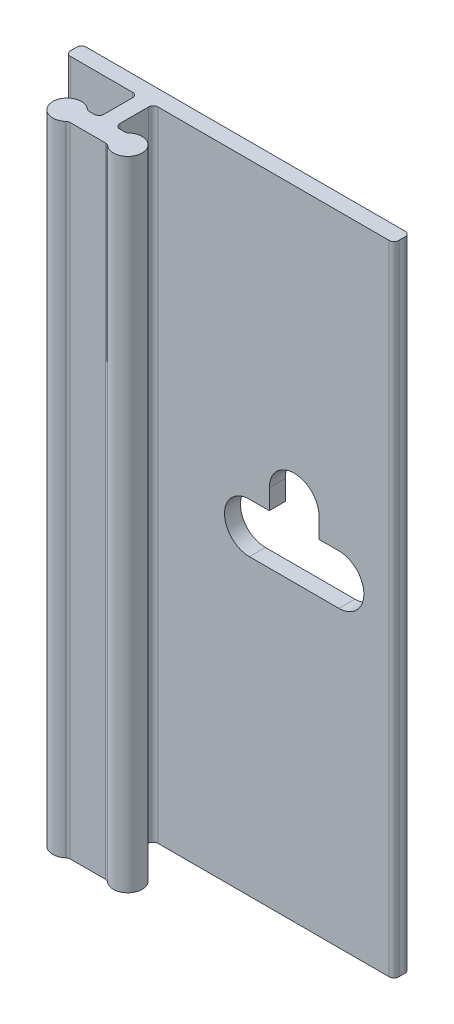
ISO-10303-21;
HEADER;
FILE_DESCRIPTION(('STEP AP214'),'2;1');
FILE_NAME('part.step','',(''),(''),'','','');
FILE_SCHEMA(('AUTOMOTIVE_DESIGN { 1 0 10303 214 1 1 1 1 }'));
ENDSEC;
DATA;
#1=APPLICATION_CONTEXT('core data for automotive mechanical design processes');
#2=APPLICATION_PROTOCOL_DEFINITION('international standard','automotive_design',2000,#1);
#3=PRODUCT_CONTEXT('',#1,'mechanical');
#4=PRODUCT('Part','Part','',(#3));
#5=PRODUCT_RELATED_PRODUCT_CATEGORY('part','',(#4));
#6=PRODUCT_DEFINITION_FORMATION('','',#4);
#7=PRODUCT_DEFINITION_CONTEXT('part definition',#1,'design');
#8=PRODUCT_DEFINITION('design','',#6,#7);
#9=PRODUCT_DEFINITION_SHAPE('','',#8);
#10=(LENGTH_UNIT() NAMED_UNIT(*) SI_UNIT(.MILLI.,.METRE.));
#11=(NAMED_UNIT(*) PLANE_ANGLE_UNIT() SI_UNIT($,.RADIAN.));
#12=(NAMED_UNIT(*) SI_UNIT($,.STERADIAN.) SOLID_ANGLE_UNIT());
#13=UNCERTAINTY_MEASURE_WITH_UNIT(LENGTH_MEASURE(1.E-05),#10,'distance_accuracy_value','');
#14=(GEOMETRIC_REPRESENTATION_CONTEXT(3) GLOBAL_UNCERTAINTY_ASSIGNED_CONTEXT((#13)) GLOBAL_UNIT_ASSIGNED_CONTEXT((#10,
#11,#12)) REPRESENTATION_CONTEXT('',''));
#15=CARTESIAN_POINT('',(0.,0.,0.));
#16=DIRECTION('',(0.,0.,1.));
#17=DIRECTION('',(1.,0.,0.));
#18=AXIS2_PLACEMENT_3D('',#15,#16,#17);
#19=CARTESIAN_POINT('',(-5.96900000000001,50.8,0.381));
#20=DIRECTION('',(0.,-1.,0.));
#21=DIRECTION('',(0.,0.,-1.));
#22=AXIS2_PLACEMENT_3D('',#19,#20,#21);
#23=CYLINDRICAL_SURFACE('',#22,0.381);
#24=CARTESIAN_POINT('',(-5.96900000000001,0.,0.381));
#25=DIRECTION('',(0.,1.,0.));
#26=DIRECTION('',(0.,0.,-1.));
#27=AXIS2_PLACEMENT_3D('',#24,#25,#26);
#28=CIRCLE('',#27,0.381);
#29=CARTESIAN_POINT('',(-5.96900000000001,0.,0.));
#30=VERTEX_POINT('',#29);
#31=CARTESIAN_POINT('',(-6.35000000000001,0.,0.381000000000002));
#32=VERTEX_POINT('',#31);
#33=EDGE_CURVE('E297',#30,#32,#28,.T.);
#34=ORIENTED_EDGE('',*,*,#33,.T.);
#35=DIRECTION('',(0.,-1.,0.));
#36=VECTOR('',#35,1.);
#37=CARTESIAN_POINT('',(-6.35000000000001,50.8,0.381000000000002));
#38=LINE('',#37,#36);
#39=CARTESIAN_POINT('',(-6.35000000000001,50.8,0.381000000000002));
#40=VERTEX_POINT('',#39);
#41=EDGE_CURVE('E11',#40,#32,#38,.T.);
#42=ORIENTED_EDGE('',*,*,#41,.F.);
#43=CARTESIAN_POINT('',(-5.96900000000001,50.8,0.381));
#44=DIRECTION('',(0.,1.,0.));
#45=DIRECTION('',(0.,0.,-1.));
#46=AXIS2_PLACEMENT_3D('',#43,#44,#45);
#47=CIRCLE('',#46,0.381);
#48=CARTESIAN_POINT('',(-5.96900000000001,50.8,0.));
#49=VERTEX_POINT('',#48);
#50=EDGE_CURVE('E309',#49,#40,#47,.T.);
#51=ORIENTED_EDGE('',*,*,#50,.F.);
#52=DIRECTION('',(0.,-1.,0.));
#53=VECTOR('',#52,1.);
#54=CARTESIAN_POINT('',(-5.96900000000001,50.8,0.));
#55=LINE('',#54,#53);
#56=EDGE_CURVE('E359',#49,#30,#55,.T.);
#57=ORIENTED_EDGE('',*,*,#56,.T.);
#58=EDGE_LOOP('',(#34,#42,#51,#57));
#59=FACE_BOUND('',#58,.T.);
#60=ADVANCED_FACE('F32',(#59),#23,.T.);
#61=CARTESIAN_POINT('',(-6.35000000000001,50.8,0.889000000000004));
#62=DIRECTION('',(1.,0.,0.));
#63=DIRECTION('',(0.,0.,-1.));
#64=AXIS2_PLACEMENT_3D('',#61,#62,#63);
#65=PLANE('',#64);
#66=DIRECTION('',(0.,0.,1.));
#67=VECTOR('',#66,1.);
#68=CARTESIAN_POINT('',(-6.35000000000001,0.,0.889000000000004));
#69=LINE('',#68,#67);
#70=CARTESIAN_POINT('',(-6.35000000000001,0.,0.889000000000004));
#71=VERTEX_POINT('',#70);
#72=EDGE_CURVE('E362',#32,#71,#69,.T.);
#73=ORIENTED_EDGE('',*,*,#72,.T.);
#74=DIRECTION('',(0.,-1.,0.));
#75=VECTOR('',#74,1.);
#76=CARTESIAN_POINT('',(-6.35000000000001,50.8,0.889000000000004));
#77=LINE('',#76,#75);
#78=CARTESIAN_POINT('',(-6.35000000000001,50.8,0.889000000000004));
#79=VERTEX_POINT('',#78);
#80=EDGE_CURVE('E39',#79,#71,#77,.T.);
#81=ORIENTED_EDGE('',*,*,#80,.F.);
#82=DIRECTION('',(0.,0.,1.));
#83=VECTOR('',#82,1.);
#84=CARTESIAN_POINT('',(-6.35000000000001,50.8,0.889000000000004));
#85=LINE('',#84,#83);
#86=EDGE_CURVE('E312',#40,#79,#85,.T.);
#87=ORIENTED_EDGE('',*,*,#86,.F.);
#88=ORIENTED_EDGE('',*,*,#41,.T.);
#89=EDGE_LOOP('',(#73,#81,#87,#88));
#90=FACE_BOUND('',#89,.T.);
#91=ADVANCED_FACE('F499',(#90),#65,.F.);
#92=CARTESIAN_POINT('',(-5.96900000000001,50.8,0.889000000000004));
#93=DIRECTION('',(0.,-1.,0.));
#94=DIRECTION('',(0.,0.,-1.));
#95=AXIS2_PLACEMENT_3D('',#92,#93,#94);
#96=CYLINDRICAL_SURFACE('',#95,0.381000000000001);
#97=CARTESIAN_POINT('',(-5.96900000000001,0.,0.889000000000004));
#98=DIRECTION('',(0.,1.,0.));
#99=DIRECTION('',(0.,0.,-1.));
#100=AXIS2_PLACEMENT_3D('',#97,#98,#99);
#101=CIRCLE('',#100,0.381000000000001);
#102=CARTESIAN_POINT('',(-5.96900000000001,0.,1.27000000000001));
#103=VERTEX_POINT('',#102);
#104=EDGE_CURVE('E364',#71,#103,#101,.T.);
#105=ORIENTED_EDGE('',*,*,#104,.T.);
#106=DIRECTION('',(0.,-1.,0.));
#107=VECTOR('',#106,1.);
#108=CARTESIAN_POINT('',(-5.96900000000001,50.8,1.27000000000001));
#109=LINE('',#108,#107);
#110=CARTESIAN_POINT('',(-5.96900000000001,50.8,1.27000000000001));
#111=VERTEX_POINT('',#110);
#112=EDGE_CURVE('E469',#111,#103,#109,.T.);
#113=ORIENTED_EDGE('',*,*,#112,.F.);
#114=CARTESIAN_POINT('',(-5.96900000000001,50.8,0.889000000000004));
#115=DIRECTION('',(0.,1.,0.));
#116=DIRECTION('',(0.,0.,-1.));
#117=AXIS2_PLACEMENT_3D('',#114,#115,#116);
#118=CIRCLE('',#117,0.381000000000001);
#119=EDGE_CURVE('E315',#79,#111,#118,.T.);
#120=ORIENTED_EDGE('',*,*,#119,.F.);
#121=ORIENTED_EDGE('',*,*,#80,.T.);
#122=EDGE_LOOP('',(#105,#113,#120,#121));
#123=FACE_BOUND('',#122,.T.);
#124=ADVANCED_FACE('F476',(#123),#96,.T.);
#125=CARTESIAN_POINT('',(-1.016,50.8,1.27));
#126=DIRECTION('',(0.,0.,-1.));
#127=DIRECTION('',(-1.,0.,0.));
#128=AXIS2_PLACEMENT_3D('',#125,#126,#127);
#129=PLANE('',#128);
#130=DIRECTION('',(1.,0.,0.));
#131=VECTOR('',#130,1.);
#132=CARTESIAN_POINT('',(-1.016,0.,1.27));
#133=LINE('',#132,#131);
#134=CARTESIAN_POINT('',(-1.016,0.,1.27));
#135=VERTEX_POINT('',#134);
#136=EDGE_CURVE('E366',#103,#135,#133,.T.);
#137=ORIENTED_EDGE('',*,*,#136,.T.);
#138=DIRECTION('',(0.,-1.,0.));
#139=VECTOR('',#138,1.);
#140=CARTESIAN_POINT('',(-1.016,50.8,1.27));
#141=LINE('',#140,#139);
#142=CARTESIAN_POINT('',(-1.016,50.8,1.27));
#143=VERTEX_POINT('',#142);
#144=EDGE_CURVE('E466',#143,#135,#141,.T.);
#145=ORIENTED_EDGE('',*,*,#144,.F.);
#146=DIRECTION('',(1.,0.,0.));
#147=VECTOR('',#146,1.);
#148=CARTESIAN_POINT('',(-1.016,50.8,1.27));
#149=LINE('',#148,#147);
#150=EDGE_CURVE('E317',#111,#143,#149,.T.);
#151=ORIENTED_EDGE('',*,*,#150,.F.);
#152=ORIENTED_EDGE('',*,*,#112,.T.);
#153=EDGE_LOOP('',(#137,#145,#151,#152));
#154=FACE_BOUND('',#153,.T.);
#155=ADVANCED_FACE('F487',(#154),#129,.F.);
#156=CARTESIAN_POINT('',(-1.016,50.8,1.651));
#157=DIRECTION('',(0.,-1.,0.));
#158=DIRECTION('',(0.,0.,-1.));
#159=AXIS2_PLACEMENT_3D('',#156,#157,#158);
#160=CYLINDRICAL_SURFACE('',#159,0.381);
#161=CARTESIAN_POINT('',(-1.016,0.,1.651));
#162=DIRECTION('',(0.,-1.,0.));
#163=DIRECTION('',(0.,0.,-1.));
#164=AXIS2_PLACEMENT_3D('',#161,#162,#163);
#165=CIRCLE('',#164,0.381);
#166=CARTESIAN_POINT('',(-0.634999999999999,0.,1.651));
#167=VERTEX_POINT('',#166);
#168=EDGE_CURVE('E368',#135,#167,#165,.T.);
#169=ORIENTED_EDGE('',*,*,#168,.T.);
#170=DIRECTION('',(0.,-1.,0.));
#171=VECTOR('',#170,1.);
#172=CARTESIAN_POINT('',(-0.634999999999999,50.8,1.651));
#173=LINE('',#172,#171);
#174=CARTESIAN_POINT('',(-0.634999999999999,50.8,1.651));
#175=VERTEX_POINT('',#174);
#176=EDGE_CURVE('E463',#175,#167,#173,.T.);
#177=ORIENTED_EDGE('',*,*,#176,.F.);
#178=CARTESIAN_POINT('',(-1.016,50.8,1.651));
#179=DIRECTION('',(0.,-1.,0.));
#180=DIRECTION('',(0.,0.,-1.));
#181=AXIS2_PLACEMENT_3D('',#178,#179,#180);
#182=CIRCLE('',#181,0.381);
#183=EDGE_CURVE('E319',#143,#175,#182,.T.);
#184=ORIENTED_EDGE('',*,*,#183,.F.);
#185=ORIENTED_EDGE('',*,*,#144,.T.);
#186=EDGE_LOOP('',(#169,#177,#184,#185));
#187=FACE_BOUND('',#186,.T.);
#188=ADVANCED_FACE('F491',(#187),#160,.F.);
#189=CARTESIAN_POINT('',(-0.634999999999999,50.8,1.651));
#190=DIRECTION('',(1.,0.,0.));
#191=DIRECTION('',(0.,0.,-1.));
#192=AXIS2_PLACEMENT_3D('',#189,#190,#191);
#193=PLANE('',#192);
#194=DIRECTION('',(0.,0.,1.));
#195=VECTOR('',#194,1.);
#196=CARTESIAN_POINT('',(-0.634999999999999,0.,1.651));
#197=LINE('',#196,#195);
#198=CARTESIAN_POINT('',(-0.634999999999999,0.,3.937));
#199=VERTEX_POINT('',#198);
#200=EDGE_CURVE('E370',#167,#199,#197,.T.);
#201=ORIENTED_EDGE('',*,*,#200,.T.);
#202=DIRECTION('',(0.,-1.,0.));
#203=VECTOR('',#202,1.);
#204=CARTESIAN_POINT('',(-0.634999999999999,50.8,3.937));
#205=LINE('',#204,#203);
#206=CARTESIAN_POINT('',(-0.634999999999999,50.8,3.937));
#207=VERTEX_POINT('',#206);
#208=EDGE_CURVE('E460',#207,#199,#205,.T.);
#209=ORIENTED_EDGE('',*,*,#208,.F.);
#210=DIRECTION('',(0.,0.,1.));
#211=VECTOR('',#210,1.);
#212=CARTESIAN_POINT('',(-0.634999999999999,50.8,1.651));
#213=LINE('',#212,#211);
#214=EDGE_CURVE('E321',#175,#207,#213,.T.);
#215=ORIENTED_EDGE('',*,*,#214,.F.);
#216=ORIENTED_EDGE('',*,*,#176,.T.);
#217=EDGE_LOOP('',(#201,#209,#215,#216));
#218=FACE_BOUND('',#217,.T.);
#219=ADVANCED_FACE('F590',(#218),#193,.F.);
#220=CARTESIAN_POINT('',(-1.016,50.8,3.937));
#221=DIRECTION('',(0.,-1.,0.));
#222=DIRECTION('',(0.,0.,-1.));
#223=AXIS2_PLACEMENT_3D('',#220,#221,#222);
#224=CYLINDRICAL_SURFACE('',#223,0.381);
#225=CARTESIAN_POINT('',(-1.016,0.,3.937));
#226=DIRECTION('',(0.,-1.,0.));
#227=DIRECTION('',(0.,0.,-1.));
#228=AXIS2_PLACEMENT_3D('',#225,#226,#227);
#229=CIRCLE('',#228,0.381);
#230=CARTESIAN_POINT('',(-1.016,0.,4.318));
#231=VERTEX_POINT('',#230);
#232=EDGE_CURVE('E372',#199,#231,#229,.T.);
#233=ORIENTED_EDGE('',*,*,#232,.T.);
#234=DIRECTION('',(0.,-1.,0.));
#235=VECTOR('',#234,1.);
#236=CARTESIAN_POINT('',(-1.016,50.8,4.318));
#237=LINE('',#236,#235);
#238=CARTESIAN_POINT('',(-1.016,50.8,4.318));
#239=VERTEX_POINT('',#238);
#240=EDGE_CURVE('E457',#239,#231,#237,.T.);
#241=ORIENTED_EDGE('',*,*,#240,.F.);
#242=CARTESIAN_POINT('',(-1.016,50.8,3.937));
#243=DIRECTION('',(0.,-1.,0.));
#244=DIRECTION('',(0.,0.,-1.));
#245=AXIS2_PLACEMENT_3D('',#242,#243,#244);
#246=CIRCLE('',#245,0.381);
#247=EDGE_CURVE('E323',#207,#239,#246,.T.);
#248=ORIENTED_EDGE('',*,*,#247,.F.);
#249=ORIENTED_EDGE('',*,*,#208,.T.);
#250=EDGE_LOOP('',(#233,#241,#248,#249));
#251=FACE_BOUND('',#250,.T.);
#252=ADVANCED_FACE('F588',(#251),#224,.F.);
#253=CARTESIAN_POINT('',(-1.40496875048439,50.8,4.318));
#254=DIRECTION('',(0.,0.,1.));
#255=DIRECTION('',(1.,0.,0.));
#256=AXIS2_PLACEMENT_3D('',#253,#254,#255);
#257=PLANE('',#256);
#258=DIRECTION('',(-1.,0.,0.));
#259=VECTOR('',#258,1.);
#260=CARTESIAN_POINT('',(-1.40496875048439,0.,4.318));
#261=LINE('',#260,#259);
#262=CARTESIAN_POINT('',(-1.40496875048439,0.,4.318));
#263=VERTEX_POINT('',#262);
#264=EDGE_CURVE('E374',#231,#263,#261,.T.);
#265=ORIENTED_EDGE('',*,*,#264,.T.);
#266=DIRECTION('',(0.,-1.,0.));
#267=VECTOR('',#266,1.);
#268=CARTESIAN_POINT('',(-1.40496875048439,50.8,4.318));
#269=LINE('',#268,#267);
#270=CARTESIAN_POINT('',(-1.40496875048439,50.8,4.318));
#271=VERTEX_POINT('',#270);
#272=EDGE_CURVE('E454',#271,#263,#269,.T.);
#273=ORIENTED_EDGE('',*,*,#272,.F.);
#274=DIRECTION('',(-1.,0.,0.));
#275=VECTOR('',#274,1.);
#276=CARTESIAN_POINT('',(-1.40496875048439,50.8,4.318));
#277=LINE('',#276,#275);
#278=EDGE_CURVE('E325',#239,#271,#277,.T.);
#279=ORIENTED_EDGE('',*,*,#278,.F.);
#280=ORIENTED_EDGE('',*,*,#240,.T.);
#281=EDGE_LOOP('',(#265,#273,#279,#280));
#282=FACE_BOUND('',#281,.T.);
#283=ADVANCED_FACE('F584',(#282),#257,.F.);
#284=CARTESIAN_POINT('',(-1.40496875048439,50.8,3.937));
#285=DIRECTION('',(0.,-1.,0.));
#286=DIRECTION('',(0.,0.,-1.));
#287=AXIS2_PLACEMENT_3D('',#284,#285,#286);
#288=CYLINDRICAL_SURFACE('',#287,0.381);
#289=CARTESIAN_POINT('',(-1.40496875048439,0.,3.937));
#290=DIRECTION('',(0.,-1.,0.));
#291=DIRECTION('',(0.,0.,-1.));
#292=AXIS2_PLACEMENT_3D('',#289,#290,#291);
#293=CIRCLE('',#292,0.381);
#294=CARTESIAN_POINT('',(-1.65697656286329,0.,4.22275));
#295=VERTEX_POINT('',#294);
#296=EDGE_CURVE('E376',#263,#295,#293,.T.);
#297=ORIENTED_EDGE('',*,*,#296,.T.);
#298=DIRECTION('',(0.,-1.,0.));
#299=VECTOR('',#298,1.);
#300=CARTESIAN_POINT('',(-1.65697656286329,50.8,4.22275));
#301=LINE('',#300,#299);
#302=CARTESIAN_POINT('',(-1.65697656286329,50.8,4.22275));
#303=VERTEX_POINT('',#302);
#304=EDGE_CURVE('E451',#303,#295,#301,.T.);
#305=ORIENTED_EDGE('',*,*,#304,.F.);
#306=CARTESIAN_POINT('',(-1.40496875048439,50.8,3.937));
#307=DIRECTION('',(0.,-1.,0.));
#308=DIRECTION('',(0.,0.,-1.));
#309=AXIS2_PLACEMENT_3D('',#306,#307,#308);
#310=CIRCLE('',#309,0.381);
#311=EDGE_CURVE('E327',#271,#303,#310,.T.);
#312=ORIENTED_EDGE('',*,*,#311,.F.);
#313=ORIENTED_EDGE('',*,*,#272,.T.);
#314=EDGE_LOOP('',(#297,#305,#312,#313));
#315=FACE_BOUND('',#314,.T.);
#316=ADVANCED_FACE('F579',(#315),#288,.F.);
#317=CARTESIAN_POINT('',(-2.413,50.8,5.08));
#318=DIRECTION('',(0.,-1.,0.));
#319=DIRECTION('',(0.,0.,-1.));
#320=AXIS2_PLACEMENT_3D('',#317,#318,#319);
#321=CYLINDRICAL_SURFACE('',#320,1.143);
#322=CARTESIAN_POINT('',(-2.413,0.,5.08));
#323=DIRECTION('',(0.,1.,0.));
#324=DIRECTION('',(0.,0.,1.));
#325=AXIS2_PLACEMENT_3D('',#322,#323,#324);
#326=CIRCLE('',#325,1.143);
#327=CARTESIAN_POINT('',(-1.65697656286329,0.,5.93725));
#328=VERTEX_POINT('',#327);
#329=EDGE_CURVE('E378',#295,#328,#326,.T.);
#330=ORIENTED_EDGE('',*,*,#329,.T.);
#331=DIRECTION('',(0.,-1.,0.));
#332=VECTOR('',#331,1.);
#333=CARTESIAN_POINT('',(-1.65697656286329,50.8,5.93725));
#334=LINE('',#333,#332);
#335=CARTESIAN_POINT('',(-1.65697656286329,50.8,5.93725));
#336=VERTEX_POINT('',#335);
#337=EDGE_CURVE('E448',#336,#328,#334,.T.);
#338=ORIENTED_EDGE('',*,*,#337,.F.);
#339=CARTESIAN_POINT('',(-2.413,50.8,5.08));
#340=DIRECTION('',(0.,1.,0.));
#341=DIRECTION('',(0.,0.,1.));
#342=AXIS2_PLACEMENT_3D('',#339,#340,#341);
#343=CIRCLE('',#342,1.143);
#344=EDGE_CURVE('E329',#303,#336,#343,.T.);
#345=ORIENTED_EDGE('',*,*,#344,.F.);
#346=ORIENTED_EDGE('',*,*,#304,.T.);
#347=EDGE_LOOP('',(#330,#338,#345,#346));
#348=FACE_BOUND('',#347,.T.);
#349=ADVANCED_FACE('F573',(#348),#321,.T.);
#350=CARTESIAN_POINT('',(-1.40496875048439,50.8,6.223));
#351=DIRECTION('',(0.,-1.,0.));
#352=DIRECTION('',(0.,0.,-1.));
#353=AXIS2_PLACEMENT_3D('',#350,#351,#352);
#354=CYLINDRICAL_SURFACE('',#353,0.381);
#355=CARTESIAN_POINT('',(-1.40496875048439,0.,6.223));
#356=DIRECTION('',(0.,-1.,0.));
#357=DIRECTION('',(0.,0.,1.));
#358=AXIS2_PLACEMENT_3D('',#355,#356,#357);
#359=CIRCLE('',#358,0.381);
#360=CARTESIAN_POINT('',(-1.40496875048439,0.,5.842));
#361=VERTEX_POINT('',#360);
#362=EDGE_CURVE('E380',#328,#361,#359,.T.);
#363=ORIENTED_EDGE('',*,*,#362,.T.);
#364=DIRECTION('',(0.,-1.,0.));
#365=VECTOR('',#364,1.);
#366=CARTESIAN_POINT('',(-1.40496875048439,50.8,5.842));
#367=LINE('',#366,#365);
#368=CARTESIAN_POINT('',(-1.40496875048439,50.8,5.842));
#369=VERTEX_POINT('',#368);
#370=EDGE_CURVE('E445',#369,#361,#367,.T.);
#371=ORIENTED_EDGE('',*,*,#370,.F.);
#372=CARTESIAN_POINT('',(-1.40496875048439,50.8,6.223));
#373=DIRECTION('',(0.,-1.,0.));
#374=DIRECTION('',(0.,0.,1.));
#375=AXIS2_PLACEMENT_3D('',#372,#373,#374);
#376=CIRCLE('',#375,0.381);
#377=EDGE_CURVE('E331',#336,#369,#376,.T.);
#378=ORIENTED_EDGE('',*,*,#377,.F.);
#379=ORIENTED_EDGE('',*,*,#337,.T.);
#380=EDGE_LOOP('',(#363,#371,#378,#379));
#381=FACE_BOUND('',#380,.T.);
#382=ADVANCED_FACE('F569',(#381),#354,.F.);
#383=CARTESIAN_POINT('',(-1.40496875048439,50.8,5.842));
#384=DIRECTION('',(0.,0.,-1.));
#385=DIRECTION('',(-1.,0.,0.));
#386=AXIS2_PLACEMENT_3D('',#383,#384,#385);
#387=PLANE('',#386);
#388=DIRECTION('',(1.,0.,0.));
#389=VECTOR('',#388,1.);
#390=CARTESIAN_POINT('',(-1.40496875048439,0.,5.842));
#391=LINE('',#390,#389);
#392=CARTESIAN_POINT('',(1.40496875048439,0.,5.842));
#393=VERTEX_POINT('',#392);
#394=EDGE_CURVE('E382',#361,#393,#391,.T.);
#395=ORIENTED_EDGE('',*,*,#394,.T.);
#396=DIRECTION('',(0.,-1.,0.));
#397=VECTOR('',#396,1.);
#398=CARTESIAN_POINT('',(1.40496875048439,50.8,5.842));
#399=LINE('',#398,#397);
#400=CARTESIAN_POINT('',(1.40496875048439,50.8,5.842));
#401=VERTEX_POINT('',#400);
#402=EDGE_CURVE('E442',#401,#393,#399,.T.);
#403=ORIENTED_EDGE('',*,*,#402,.F.);
#404=DIRECTION('',(1.,0.,0.));
#405=VECTOR('',#404,1.);
#406=CARTESIAN_POINT('',(-1.40496875048439,50.8,5.842));
#407=LINE('',#406,#405);
#408=EDGE_CURVE('E333',#369,#401,#407,.T.);
#409=ORIENTED_EDGE('',*,*,#408,.F.);
#410=ORIENTED_EDGE('',*,*,#370,.T.);
#411=EDGE_LOOP('',(#395,#403,#409,#410));
#412=FACE_BOUND('',#411,.T.);
#413=ADVANCED_FACE('F564',(#412),#387,.F.);
#414=CARTESIAN_POINT('',(1.40496875048439,50.8,6.223));
#415=DIRECTION('',(0.,-1.,0.));
#416=DIRECTION('',(0.,0.,-1.));
#417=AXIS2_PLACEMENT_3D('',#414,#415,#416);
#418=CYLINDRICAL_SURFACE('',#417,0.381);
#419=CARTESIAN_POINT('',(1.40496875048439,0.,6.223));
#420=DIRECTION('',(0.,-1.,0.));
#421=DIRECTION('',(0.,0.,-1.));
#422=AXIS2_PLACEMENT_3D('',#419,#420,#421);
#423=CIRCLE('',#422,0.381);
#424=CARTESIAN_POINT('',(1.65697656286329,0.,5.93725));
#425=VERTEX_POINT('',#424);
#426=EDGE_CURVE('E384',#393,#425,#423,.T.);
#427=ORIENTED_EDGE('',*,*,#426,.T.);
#428=DIRECTION('',(0.,-1.,0.));
#429=VECTOR('',#428,1.);
#430=CARTESIAN_POINT('',(1.65697656286329,50.8,5.93725));
#431=LINE('',#430,#429);
#432=CARTESIAN_POINT('',(1.65697656286329,50.8,5.93725));
#433=VERTEX_POINT('',#432);
#434=EDGE_CURVE('E439',#433,#425,#431,.T.);
#435=ORIENTED_EDGE('',*,*,#434,.F.);
#436=CARTESIAN_POINT('',(1.40496875048439,50.8,6.223));
#437=DIRECTION('',(0.,-1.,0.));
#438=DIRECTION('',(0.,0.,-1.));
#439=AXIS2_PLACEMENT_3D('',#436,#437,#438);
#440=CIRCLE('',#439,0.381);
#441=EDGE_CURVE('E335',#401,#433,#440,.T.);
#442=ORIENTED_EDGE('',*,*,#441,.F.);
#443=ORIENTED_EDGE('',*,*,#402,.T.);
#444=EDGE_LOOP('',(#427,#435,#442,#443));
#445=FACE_BOUND('',#444,.T.);
#446=ADVANCED_FACE('F558',(#445),#418,.F.);
#447=CARTESIAN_POINT('',(2.413,50.8,5.08));
#448=DIRECTION('',(0.,-1.,0.));
#449=DIRECTION('',(0.,0.,-1.));
#450=AXIS2_PLACEMENT_3D('',#447,#448,#449);
#451=CYLINDRICAL_SURFACE('',#450,1.143);
#452=CARTESIAN_POINT('',(2.413,0.,5.08));
#453=DIRECTION('',(0.,1.,0.));
#454=DIRECTION('',(0.,0.,1.));
#455=AXIS2_PLACEMENT_3D('',#452,#453,#454);
#456=CIRCLE('',#455,1.143);
#457=CARTESIAN_POINT('',(1.6569765628633,0.,4.22275));
#458=VERTEX_POINT('',#457);
#459=EDGE_CURVE('E386',#425,#458,#456,.T.);
#460=ORIENTED_EDGE('',*,*,#459,.T.);
#461=DIRECTION('',(0.,-1.,0.));
#462=VECTOR('',#461,1.);
#463=CARTESIAN_POINT('',(1.6569765628633,50.8,4.22275));
#464=LINE('',#463,#462);
#465=CARTESIAN_POINT('',(1.6569765628633,50.8,4.22275));
#466=VERTEX_POINT('',#465);
#467=EDGE_CURVE('E436',#466,#458,#464,.T.);
#468=ORIENTED_EDGE('',*,*,#467,.F.);
#469=CARTESIAN_POINT('',(2.413,50.8,5.08));
#470=DIRECTION('',(0.,1.,0.));
#471=DIRECTION('',(0.,0.,1.));
#472=AXIS2_PLACEMENT_3D('',#469,#470,#471);
#473=CIRCLE('',#472,1.143);
#474=EDGE_CURVE('E337',#433,#466,#473,.T.);
#475=ORIENTED_EDGE('',*,*,#474,.F.);
#476=ORIENTED_EDGE('',*,*,#434,.T.);
#477=EDGE_LOOP('',(#460,#468,#475,#476));
#478=FACE_BOUND('',#477,.T.);
#479=ADVANCED_FACE('F554',(#478),#451,.T.);
#480=CARTESIAN_POINT('',(1.40496875048439,50.8,3.937));
#481=DIRECTION('',(0.,-1.,0.));
#482=DIRECTION('',(0.,0.,-1.));
#483=AXIS2_PLACEMENT_3D('',#480,#481,#482);
#484=CYLINDRICAL_SURFACE('',#483,0.381000000000001);
#485=CARTESIAN_POINT('',(1.40496875048439,0.,3.937));
#486=DIRECTION('',(0.,-1.,0.));
#487=DIRECTION('',(0.,0.,-1.));
#488=AXIS2_PLACEMENT_3D('',#485,#486,#487);
#489=CIRCLE('',#488,0.381000000000001);
#490=CARTESIAN_POINT('',(1.40496875048439,0.,4.318));
#491=VERTEX_POINT('',#490);
#492=EDGE_CURVE('E388',#458,#491,#489,.T.);
#493=ORIENTED_EDGE('',*,*,#492,.T.);
#494=DIRECTION('',(0.,-1.,0.));
#495=VECTOR('',#494,1.);
#496=CARTESIAN_POINT('',(1.40496875048439,50.8,4.318));
#497=LINE('',#496,#495);
#498=CARTESIAN_POINT('',(1.40496875048439,50.8,4.318));
#499=VERTEX_POINT('',#498);
#500=EDGE_CURVE('E433',#499,#491,#497,.T.);
#501=ORIENTED_EDGE('',*,*,#500,.F.);
#502=CARTESIAN_POINT('',(1.40496875048439,50.8,3.937));
#503=DIRECTION('',(0.,-1.,0.));
#504=DIRECTION('',(0.,0.,-1.));
#505=AXIS2_PLACEMENT_3D('',#502,#503,#504);
#506=CIRCLE('',#505,0.381000000000001);
#507=EDGE_CURVE('E339',#466,#499,#506,.T.);
#508=ORIENTED_EDGE('',*,*,#507,.F.);
#509=ORIENTED_EDGE('',*,*,#467,.T.);
#510=EDGE_LOOP('',(#493,#501,#508,#509));
#511=FACE_BOUND('',#510,.T.);
#512=ADVANCED_FACE('F549',(#511),#484,.F.);
#513=CARTESIAN_POINT('',(1.016,50.8,4.318));
#514=DIRECTION('',(0.,0.,1.));
#515=DIRECTION('',(1.,0.,0.));
#516=AXIS2_PLACEMENT_3D('',#513,#514,#515);
#517=PLANE('',#516);
#518=DIRECTION('',(-1.,0.,0.));
#519=VECTOR('',#518,1.);
#520=CARTESIAN_POINT('',(1.016,0.,4.318));
#521=LINE('',#520,#519);
#522=CARTESIAN_POINT('',(1.016,0.,4.318));
#523=VERTEX_POINT('',#522);
#524=EDGE_CURVE('E390',#491,#523,#521,.T.);
#525=ORIENTED_EDGE('',*,*,#524,.T.);
#526=DIRECTION('',(0.,-1.,0.));
#527=VECTOR('',#526,1.);
#528=CARTESIAN_POINT('',(1.016,50.8,4.318));
#529=LINE('',#528,#527);
#530=CARTESIAN_POINT('',(1.016,50.8,4.318));
#531=VERTEX_POINT('',#530);
#532=EDGE_CURVE('E430',#531,#523,#529,.T.);
#533=ORIENTED_EDGE('',*,*,#532,.F.);
#534=DIRECTION('',(-1.,0.,0.));
#535=VECTOR('',#534,1.);
#536=CARTESIAN_POINT('',(1.016,50.8,4.318));
#537=LINE('',#536,#535);
#538=EDGE_CURVE('E341',#499,#531,#537,.T.);
#539=ORIENTED_EDGE('',*,*,#538,.F.);
#540=ORIENTED_EDGE('',*,*,#500,.T.);
#541=EDGE_LOOP('',(#525,#533,#539,#540));
#542=FACE_BOUND('',#541,.T.);
#543=ADVANCED_FACE('F543',(#542),#517,.F.);
#544=CARTESIAN_POINT('',(1.016,50.8,3.937));
#545=DIRECTION('',(0.,-1.,0.));
#546=DIRECTION('',(0.,0.,-1.));
#547=AXIS2_PLACEMENT_3D('',#544,#545,#546);
#548=CYLINDRICAL_SURFACE('',#547,0.381);
#549=CARTESIAN_POINT('',(1.016,0.,3.937));
#550=DIRECTION('',(0.,-1.,0.));
#551=DIRECTION('',(0.,0.,1.));
#552=AXIS2_PLACEMENT_3D('',#549,#550,#551);
#553=CIRCLE('',#552,0.381);
#554=CARTESIAN_POINT('',(0.635000000000002,0.,3.937));
#555=VERTEX_POINT('',#554);
#556=EDGE_CURVE('E392',#523,#555,#553,.T.);
#557=ORIENTED_EDGE('',*,*,#556,.T.);
#558=DIRECTION('',(0.,-1.,0.));
#559=VECTOR('',#558,1.);
#560=CARTESIAN_POINT('',(0.635000000000002,50.8,3.937));
#561=LINE('',#560,#559);
#562=CARTESIAN_POINT('',(0.635000000000002,50.8,3.937));
#563=VERTEX_POINT('',#562);
#564=EDGE_CURVE('E427',#563,#555,#561,.T.);
#565=ORIENTED_EDGE('',*,*,#564,.F.);
#566=CARTESIAN_POINT('',(1.016,50.8,3.937));
#567=DIRECTION('',(0.,-1.,0.));
#568=DIRECTION('',(0.,0.,1.));
#569=AXIS2_PLACEMENT_3D('',#566,#567,#568);
#570=CIRCLE('',#569,0.381);
#571=EDGE_CURVE('E343',#531,#563,#570,.T.);
#572=ORIENTED_EDGE('',*,*,#571,.F.);
#573=ORIENTED_EDGE('',*,*,#532,.T.);
#574=EDGE_LOOP('',(#557,#565,#572,#573));
#575=FACE_BOUND('',#574,.T.);
#576=ADVANCED_FACE('F539',(#575),#548,.F.);
#577=CARTESIAN_POINT('',(0.635000000000001,50.8,1.651));
#578=DIRECTION('',(-1.,0.,0.));
#579=DIRECTION('',(0.,0.,1.));
#580=AXIS2_PLACEMENT_3D('',#577,#578,#579);
#581=PLANE('',#580);
#582=DIRECTION('',(0.,0.,-1.));
#583=VECTOR('',#582,1.);
#584=CARTESIAN_POINT('',(0.635000000000001,0.,1.651));
#585=LINE('',#584,#583);
#586=CARTESIAN_POINT('',(0.635000000000001,0.,1.651));
#587=VERTEX_POINT('',#586);
#588=EDGE_CURVE('E394',#555,#587,#585,.T.);
#589=ORIENTED_EDGE('',*,*,#588,.T.);
#590=DIRECTION('',(0.,-1.,0.));
#591=VECTOR('',#590,1.);
#592=CARTESIAN_POINT('',(0.635000000000001,50.8,1.651));
#593=LINE('',#592,#591);
#594=CARTESIAN_POINT('',(0.635000000000001,50.8,1.651));
#595=VERTEX_POINT('',#594);
#596=EDGE_CURVE('E424',#595,#587,#593,.T.);
#597=ORIENTED_EDGE('',*,*,#596,.F.);
#598=DIRECTION('',(0.,0.,-1.));
#599=VECTOR('',#598,1.);
#600=CARTESIAN_POINT('',(0.635000000000001,50.8,1.651));
#601=LINE('',#600,#599);
#602=EDGE_CURVE('E345',#563,#595,#601,.T.);
#603=ORIENTED_EDGE('',*,*,#602,.F.);
#604=ORIENTED_EDGE('',*,*,#564,.T.);
#605=EDGE_LOOP('',(#589,#597,#603,#604));
#606=FACE_BOUND('',#605,.T.);
#607=ADVANCED_FACE('F534',(#606),#581,.F.);
#608=CARTESIAN_POINT('',(1.016,50.8,1.651));
#609=DIRECTION('',(0.,-1.,0.));
#610=DIRECTION('',(0.,0.,-1.));
#611=AXIS2_PLACEMENT_3D('',#608,#609,#610);
#612=CYLINDRICAL_SURFACE('',#611,0.381000000000001);
#613=CARTESIAN_POINT('',(1.016,0.,1.651));
#614=DIRECTION('',(0.,-1.,0.));
#615=DIRECTION('',(0.,0.,1.));
#616=AXIS2_PLACEMENT_3D('',#613,#614,#615);
#617=CIRCLE('',#616,0.381000000000001);
#618=CARTESIAN_POINT('',(1.016,0.,1.27));
#619=VERTEX_POINT('',#618);
#620=EDGE_CURVE('E396',#587,#619,#617,.T.);
#621=ORIENTED_EDGE('',*,*,#620,.T.);
#622=DIRECTION('',(0.,-1.,0.));
#623=VECTOR('',#622,1.);
#624=CARTESIAN_POINT('',(1.016,50.8,1.27));
#625=LINE('',#624,#623);
#626=CARTESIAN_POINT('',(1.016,50.8,1.27));
#627=VERTEX_POINT('',#626);
#628=EDGE_CURVE('E421',#627,#619,#625,.T.);
#629=ORIENTED_EDGE('',*,*,#628,.F.);
#630=CARTESIAN_POINT('',(1.016,50.8,1.651));
#631=DIRECTION('',(0.,-1.,0.));
#632=DIRECTION('',(0.,0.,1.));
#633=AXIS2_PLACEMENT_3D('',#630,#631,#632);
#634=CIRCLE('',#633,0.381000000000001);
#635=EDGE_CURVE('E347',#595,#627,#634,.T.);
#636=ORIENTED_EDGE('',*,*,#635,.F.);
#637=ORIENTED_EDGE('',*,*,#596,.T.);
#638=EDGE_LOOP('',(#621,#629,#636,#637));
#639=FACE_BOUND('',#638,.T.);
#640=ADVANCED_FACE('F528',(#639),#612,.F.);
#641=CARTESIAN_POINT('',(19.431,50.8,1.27));
#642=DIRECTION('',(0.,0.,-1.));
#643=DIRECTION('',(-1.,0.,0.));
#644=AXIS2_PLACEMENT_3D('',#641,#642,#643);
#645=PLANE('',#644);
#646=DIRECTION('',(1.,0.,0.));
#647=VECTOR('',#646,1.);
#648=CARTESIAN_POINT('',(8.2931,23.4188,1.27));
#649=LINE('',#648,#647);
#650=CARTESIAN_POINT('',(8.2931,23.4188,1.27));
#651=VERTEX_POINT('',#650);
#652=CARTESIAN_POINT('',(15.4305,23.4188,1.27));
#653=VERTEX_POINT('',#652);
#654=EDGE_CURVE('E279',#651,#653,#649,.T.);
#655=ORIENTED_EDGE('',*,*,#654,.F.);
#656=CARTESIAN_POINT('',(8.2931,25.4,1.27));
#657=DIRECTION('',(0.,0.,1.));
#658=DIRECTION('',(1.,0.,0.));
#659=AXIS2_PLACEMENT_3D('',#656,#657,#658);
#660=CIRCLE('',#659,1.9812);
#661=CARTESIAN_POINT('',(8.2931,27.3812,1.27));
#662=VERTEX_POINT('',#661);
#663=EDGE_CURVE('E46',#662,#651,#660,.T.);
#664=ORIENTED_EDGE('',*,*,#663,.F.);
#665=DIRECTION('',(-1.,0.,0.));
#666=VECTOR('',#665,1.);
#667=CARTESIAN_POINT('',(8.2931,27.3812,1.27));
#668=LINE('',#667,#666);
#669=CARTESIAN_POINT('',(9.8806,27.3812,1.27));
#670=VERTEX_POINT('',#669);
#671=EDGE_CURVE('E259',#670,#662,#668,.T.);
#672=ORIENTED_EDGE('',*,*,#671,.F.);
#673=DIRECTION('',(0.,-1.,0.));
#674=VECTOR('',#673,1.);
#675=CARTESIAN_POINT('',(9.8806,28.9814000000001,1.27));
#676=LINE('',#675,#674);
#677=CARTESIAN_POINT('',(9.8806,28.9814000000001,1.27));
#678=VERTEX_POINT('',#677);
#679=EDGE_CURVE('E262',#678,#670,#676,.T.);
#680=ORIENTED_EDGE('',*,*,#679,.F.);
#681=CARTESIAN_POINT('',(11.8618,28.9814000000001,1.27));
#682=DIRECTION('',(0.,0.,1.));
#683=DIRECTION('',(1.,0.,0.));
#684=AXIS2_PLACEMENT_3D('',#681,#682,#683);
#685=CIRCLE('',#684,1.9812);
#686=CARTESIAN_POINT('',(13.843,28.9814000000001,1.27));
#687=VERTEX_POINT('',#686);
#688=EDGE_CURVE('E290',#687,#678,#685,.T.);
#689=ORIENTED_EDGE('',*,*,#688,.F.);
#690=DIRECTION('',(0.,1.,0.));
#691=VECTOR('',#690,1.);
#692=CARTESIAN_POINT('',(13.843,28.9814000000001,1.27));
#693=LINE('',#692,#691);
#694=CARTESIAN_POINT('',(13.843,27.3812,1.27));
#695=VERTEX_POINT('',#694);
#696=EDGE_CURVE('E287',#695,#687,#693,.T.);
#697=ORIENTED_EDGE('',*,*,#696,.F.);
#698=DIRECTION('',(-1.,0.,0.));
#699=VECTOR('',#698,1.);
#700=CARTESIAN_POINT('',(13.843,27.3812,1.27));
#701=LINE('',#700,#699);
#702=CARTESIAN_POINT('',(15.4305,27.3812,1.27));
#703=VERTEX_POINT('',#702);
#704=EDGE_CURVE('E284',#703,#695,#701,.T.);
#705=ORIENTED_EDGE('',*,*,#704,.F.);
#706=CARTESIAN_POINT('',(15.4305,25.4,1.27));
#707=DIRECTION('',(0.,0.,1.));
#708=DIRECTION('',(1.,0.,0.));
#709=AXIS2_PLACEMENT_3D('',#706,#707,#708);
#710=CIRCLE('',#709,1.9812);
#711=EDGE_CURVE('E281',#653,#703,#710,.T.);
#712=ORIENTED_EDGE('',*,*,#711,.F.);
#713=EDGE_LOOP('',(#655,#664,#672,#680,#689,#697,#705,#712));
#714=FACE_BOUND('',#713,.T.);
#715=DIRECTION('',(1.,0.,0.));
#716=VECTOR('',#715,1.);
#717=CARTESIAN_POINT('',(19.431,0.,1.27));
#718=LINE('',#717,#716);
#719=CARTESIAN_POINT('',(19.431,0.,1.27));
#720=VERTEX_POINT('',#719);
#721=EDGE_CURVE('E398',#619,#720,#718,.T.);
#722=ORIENTED_EDGE('',*,*,#721,.T.);
#723=DIRECTION('',(0.,-1.,0.));
#724=VECTOR('',#723,1.);
#725=CARTESIAN_POINT('',(19.431,50.8,1.27));
#726=LINE('',#725,#724);
#727=CARTESIAN_POINT('',(19.431,50.8,1.27));
#728=VERTEX_POINT('',#727);
#729=EDGE_CURVE('E418',#728,#720,#726,.T.);
#730=ORIENTED_EDGE('',*,*,#729,.F.);
#731=DIRECTION('',(1.,0.,0.));
#732=VECTOR('',#731,1.);
#733=CARTESIAN_POINT('',(19.431,50.8,1.27));
#734=LINE('',#733,#732);
#735=EDGE_CURVE('E349',#627,#728,#734,.T.);
#736=ORIENTED_EDGE('',*,*,#735,.F.);
#737=ORIENTED_EDGE('',*,*,#628,.T.);
#738=EDGE_LOOP('',(#722,#730,#736,#737));
#739=FACE_BOUND('',#738,.T.);
#740=ADVANCED_FACE('F524',(#714,#739),#645,.F.);
#741=CARTESIAN_POINT('',(19.431,50.8,0.889));
#742=DIRECTION('',(0.,-1.,0.));
#743=DIRECTION('',(0.,0.,-1.));
#744=AXIS2_PLACEMENT_3D('',#741,#742,#743);
#745=CYLINDRICAL_SURFACE('',#744,0.381000000000002);
#746=CARTESIAN_POINT('',(19.431,0.,0.889));
#747=DIRECTION('',(0.,1.,0.));
#748=DIRECTION('',(0.,0.,-1.));
#749=AXIS2_PLACEMENT_3D('',#746,#747,#748);
#750=CIRCLE('',#749,0.381000000000002);
#751=CARTESIAN_POINT('',(19.812,0.,0.889));
#752=VERTEX_POINT('',#751);
#753=EDGE_CURVE('E400',#720,#752,#750,.T.);
#754=ORIENTED_EDGE('',*,*,#753,.T.);
#755=DIRECTION('',(0.,-1.,0.));
#756=VECTOR('',#755,1.);
#757=CARTESIAN_POINT('',(19.812,50.8,0.889));
#758=LINE('',#757,#756);
#759=CARTESIAN_POINT('',(19.812,50.8,0.889));
#760=VERTEX_POINT('',#759);
#761=EDGE_CURVE('E415',#760,#752,#758,.T.);
#762=ORIENTED_EDGE('',*,*,#761,.F.);
#763=CARTESIAN_POINT('',(19.431,50.8,0.889));
#764=DIRECTION('',(0.,1.,0.));
#765=DIRECTION('',(0.,0.,-1.));
#766=AXIS2_PLACEMENT_3D('',#763,#764,#765);
#767=CIRCLE('',#766,0.381000000000002);
#768=EDGE_CURVE('E351',#728,#760,#767,.T.);
#769=ORIENTED_EDGE('',*,*,#768,.F.);
#770=ORIENTED_EDGE('',*,*,#729,.T.);
#771=EDGE_LOOP('',(#754,#762,#769,#770));
#772=FACE_BOUND('',#771,.T.);
#773=ADVANCED_FACE('F519',(#772),#745,.T.);
#774=CARTESIAN_POINT('',(19.812,50.8,0.381));
#775=DIRECTION('',(-1.,0.,0.));
#776=DIRECTION('',(0.,0.,1.));
#777=AXIS2_PLACEMENT_3D('',#774,#775,#776);
#778=PLANE('',#777);
#779=DIRECTION('',(0.,0.,-1.));
#780=VECTOR('',#779,1.);
#781=CARTESIAN_POINT('',(19.812,0.,0.381));
#782=LINE('',#781,#780);
#783=CARTESIAN_POINT('',(19.812,0.,0.381));
#784=VERTEX_POINT('',#783);
#785=EDGE_CURVE('E402',#752,#784,#782,.T.);
#786=ORIENTED_EDGE('',*,*,#785,.T.);
#787=DIRECTION('',(0.,-1.,0.));
#788=VECTOR('',#787,1.);
#789=CARTESIAN_POINT('',(19.812,50.8,0.381));
#790=LINE('',#789,#788);
#791=CARTESIAN_POINT('',(19.812,50.8,0.381));
#792=VERTEX_POINT('',#791);
#793=EDGE_CURVE('E412',#792,#784,#790,.T.);
#794=ORIENTED_EDGE('',*,*,#793,.F.);
#795=DIRECTION('',(0.,0.,-1.));
#796=VECTOR('',#795,1.);
#797=CARTESIAN_POINT('',(19.812,50.8,0.381));
#798=LINE('',#797,#796);
#799=EDGE_CURVE('E353',#760,#792,#798,.T.);
#800=ORIENTED_EDGE('',*,*,#799,.F.);
#801=ORIENTED_EDGE('',*,*,#761,.T.);
#802=EDGE_LOOP('',(#786,#794,#800,#801));
#803=FACE_BOUND('',#802,.T.);
#804=ADVANCED_FACE('F513',(#803),#778,.F.);
#805=CARTESIAN_POINT('',(19.431,50.8,0.381));
#806=DIRECTION('',(0.,-1.,0.));
#807=DIRECTION('',(0.,0.,-1.));
#808=AXIS2_PLACEMENT_3D('',#805,#806,#807);
#809=CYLINDRICAL_SURFACE('',#808,0.381000000000002);
#810=CARTESIAN_POINT('',(19.431,0.,0.381));
#811=DIRECTION('',(0.,1.,0.));
#812=DIRECTION('',(0.,0.,-1.));
#813=AXIS2_PLACEMENT_3D('',#810,#811,#812);
#814=CIRCLE('',#813,0.381000000000002);
#815=CARTESIAN_POINT('',(19.431,0.,0.));
#816=VERTEX_POINT('',#815);
#817=EDGE_CURVE('E404',#784,#816,#814,.T.);
#818=ORIENTED_EDGE('',*,*,#817,.T.);
#819=DIRECTION('',(0.,-1.,0.));
#820=VECTOR('',#819,1.);
#821=CARTESIAN_POINT('',(19.431,50.8,0.));
#822=LINE('',#821,#820);
#823=CARTESIAN_POINT('',(19.431,50.8,0.));
#824=VERTEX_POINT('',#823);
#825=EDGE_CURVE('E409',#824,#816,#822,.T.);
#826=ORIENTED_EDGE('',*,*,#825,.F.);
#827=CARTESIAN_POINT('',(19.431,50.8,0.381));
#828=DIRECTION('',(0.,1.,0.));
#829=DIRECTION('',(0.,0.,-1.));
#830=AXIS2_PLACEMENT_3D('',#827,#828,#829);
#831=CIRCLE('',#830,0.381000000000002);
#832=EDGE_CURVE('E355',#792,#824,#831,.T.);
#833=ORIENTED_EDGE('',*,*,#832,.F.);
#834=ORIENTED_EDGE('',*,*,#793,.T.);
#835=EDGE_LOOP('',(#818,#826,#833,#834));
#836=FACE_BOUND('',#835,.T.);
#837=ADVANCED_FACE('F509',(#836),#809,.T.);
#838=CARTESIAN_POINT('',(-5.96900000000001,50.8,0.));
#839=DIRECTION('',(0.,0.,1.));
#840=DIRECTION('',(1.,0.,0.));
#841=AXIS2_PLACEMENT_3D('',#838,#839,#840);
#842=PLANE('',#841);
#843=DIRECTION('',(-1.,0.,0.));
#844=VECTOR('',#843,1.);
#845=CARTESIAN_POINT('',(8.2931,27.3812,0.));
#846=LINE('',#845,#844);
#847=CARTESIAN_POINT('',(9.8806,27.3812,0.));
#848=VERTEX_POINT('',#847);
#849=CARTESIAN_POINT('',(8.2931,27.3812,0.));
#850=VERTEX_POINT('',#849);
#851=EDGE_CURVE('E248',#848,#850,#846,.T.);
#852=ORIENTED_EDGE('',*,*,#851,.T.);
#853=CARTESIAN_POINT('',(8.2931,25.4,0.));
#854=DIRECTION('',(0.,0.,1.));
#855=DIRECTION('',(1.,0.,0.));
#856=AXIS2_PLACEMENT_3D('',#853,#854,#855);
#857=CIRCLE('',#856,1.9812);
#858=CARTESIAN_POINT('',(8.2931,23.4188,0.));
#859=VERTEX_POINT('',#858);
#860=EDGE_CURVE('E242',#850,#859,#857,.T.);
#861=ORIENTED_EDGE('',*,*,#860,.T.);
#862=DIRECTION('',(1.,0.,0.));
#863=VECTOR('',#862,1.);
#864=CARTESIAN_POINT('',(8.2931,23.4188,0.));
#865=LINE('',#864,#863);
#866=CARTESIAN_POINT('',(15.4305,23.4188,0.));
#867=VERTEX_POINT('',#866);
#868=EDGE_CURVE('E251',#859,#867,#865,.T.);
#869=ORIENTED_EDGE('',*,*,#868,.T.);
#870=CARTESIAN_POINT('',(15.4305,25.4,0.));
#871=DIRECTION('',(0.,0.,1.));
#872=DIRECTION('',(1.,0.,0.));
#873=AXIS2_PLACEMENT_3D('',#870,#871,#872);
#874=CIRCLE('',#873,1.9812);
#875=CARTESIAN_POINT('',(15.4305,27.3812,0.));
#876=VERTEX_POINT('',#875);
#877=EDGE_CURVE('E54',#867,#876,#874,.T.);
#878=ORIENTED_EDGE('',*,*,#877,.T.);
#879=DIRECTION('',(-1.,0.,0.));
#880=VECTOR('',#879,1.);
#881=CARTESIAN_POINT('',(13.843,27.3812,0.));
#882=LINE('',#881,#880);
#883=CARTESIAN_POINT('',(13.843,27.3812,0.));
#884=VERTEX_POINT('',#883);
#885=EDGE_CURVE('E266',#876,#884,#882,.T.);
#886=ORIENTED_EDGE('',*,*,#885,.T.);
#887=DIRECTION('',(0.,1.,0.));
#888=VECTOR('',#887,1.);
#889=CARTESIAN_POINT('',(13.843,28.9814000000001,0.));
#890=LINE('',#889,#888);
#891=CARTESIAN_POINT('',(13.843,28.9814000000001,0.));
#892=VERTEX_POINT('',#891);
#893=EDGE_CURVE('E269',#884,#892,#890,.T.);
#894=ORIENTED_EDGE('',*,*,#893,.T.);
#895=CARTESIAN_POINT('',(11.8618,28.9814000000001,0.));
#896=DIRECTION('',(0.,0.,1.));
#897=DIRECTION('',(1.,0.,0.));
#898=AXIS2_PLACEMENT_3D('',#895,#896,#897);
#899=CIRCLE('',#898,1.9812);
#900=CARTESIAN_POINT('',(9.8806,28.9814000000001,0.));
#901=VERTEX_POINT('',#900);
#902=EDGE_CURVE('E272',#892,#901,#899,.T.);
#903=ORIENTED_EDGE('',*,*,#902,.T.);
#904=DIRECTION('',(0.,-1.,0.));
#905=VECTOR('',#904,1.);
#906=CARTESIAN_POINT('',(9.8806,28.9814000000001,0.));
#907=LINE('',#906,#905);
#908=EDGE_CURVE('E275',#901,#848,#907,.T.);
#909=ORIENTED_EDGE('',*,*,#908,.T.);
#910=EDGE_LOOP('',(#852,#861,#869,#878,#886,#894,#903,#909));
#911=FACE_BOUND('',#910,.T.);
#912=DIRECTION('',(-1.,0.,0.));
#913=VECTOR('',#912,1.);
#914=CARTESIAN_POINT('',(-5.96900000000001,0.,0.));
#915=LINE('',#914,#913);
#916=EDGE_CURVE('E313',#816,#30,#915,.T.);
#917=ORIENTED_EDGE('',*,*,#916,.T.);
#918=ORIENTED_EDGE('',*,*,#56,.F.);
#919=DIRECTION('',(-1.,0.,0.));
#920=VECTOR('',#919,1.);
#921=CARTESIAN_POINT('',(-5.96900000000001,50.8,0.));
#922=LINE('',#921,#920);
#923=EDGE_CURVE('E357',#824,#49,#922,.T.);
#924=ORIENTED_EDGE('',*,*,#923,.F.);
#925=ORIENTED_EDGE('',*,*,#825,.T.);
#926=EDGE_LOOP('',(#917,#918,#924,#925));
#927=FACE_BOUND('',#926,.T.);
#928=ADVANCED_FACE('F255',(#911,#927),#842,.F.);
#929=CARTESIAN_POINT('',(-5.96900000000001,50.8,0.381));
#930=DIRECTION('',(0.,-1.,0.));
#931=DIRECTION('',(0.,0.,-1.));
#932=AXIS2_PLACEMENT_3D('',#929,#930,#931);
#933=PLANE('',#932);
#934=ORIENTED_EDGE('',*,*,#50,.T.);
#935=ORIENTED_EDGE('',*,*,#86,.T.);
#936=ORIENTED_EDGE('',*,*,#119,.T.);
#937=ORIENTED_EDGE('',*,*,#150,.T.);
#938=ORIENTED_EDGE('',*,*,#183,.T.);
#939=ORIENTED_EDGE('',*,*,#214,.T.);
#940=ORIENTED_EDGE('',*,*,#247,.T.);
#941=ORIENTED_EDGE('',*,*,#278,.T.);
#942=ORIENTED_EDGE('',*,*,#311,.T.);
#943=ORIENTED_EDGE('',*,*,#344,.T.);
#944=ORIENTED_EDGE('',*,*,#377,.T.);
#945=ORIENTED_EDGE('',*,*,#408,.T.);
#946=ORIENTED_EDGE('',*,*,#441,.T.);
#947=ORIENTED_EDGE('',*,*,#474,.T.);
#948=ORIENTED_EDGE('',*,*,#507,.T.);
#949=ORIENTED_EDGE('',*,*,#538,.T.);
#950=ORIENTED_EDGE('',*,*,#571,.T.);
#951=ORIENTED_EDGE('',*,*,#602,.T.);
#952=ORIENTED_EDGE('',*,*,#635,.T.);
#953=ORIENTED_EDGE('',*,*,#735,.T.);
#954=ORIENTED_EDGE('',*,*,#768,.T.);
#955=ORIENTED_EDGE('',*,*,#799,.T.);
#956=ORIENTED_EDGE('',*,*,#832,.T.);
#957=ORIENTED_EDGE('',*,*,#923,.T.);
#958=EDGE_LOOP('',(#934,#935,#936,#937,#938,#939,#940,#941,#942,#943,#944,#945,#946,#947,#948,
#949,#950,#951,#952,#953,#954,#955,#956,#957));
#959=FACE_BOUND('',#958,.T.);
#960=ADVANCED_FACE('F495',(#959),#933,.F.);
#961=CARTESIAN_POINT('',(-5.96900000000001,0.,0.381));
#962=DIRECTION('',(0.,-1.,0.));
#963=DIRECTION('',(0.,0.,-1.));
#964=AXIS2_PLACEMENT_3D('',#961,#962,#963);
#965=PLANE('',#964);
#966=ORIENTED_EDGE('',*,*,#33,.F.);
#967=ORIENTED_EDGE('',*,*,#916,.F.);
#968=ORIENTED_EDGE('',*,*,#817,.F.);
#969=ORIENTED_EDGE('',*,*,#785,.F.);
#970=ORIENTED_EDGE('',*,*,#753,.F.);
#971=ORIENTED_EDGE('',*,*,#721,.F.);
#972=ORIENTED_EDGE('',*,*,#620,.F.);
#973=ORIENTED_EDGE('',*,*,#588,.F.);
#974=ORIENTED_EDGE('',*,*,#556,.F.);
#975=ORIENTED_EDGE('',*,*,#524,.F.);
#976=ORIENTED_EDGE('',*,*,#492,.F.);
#977=ORIENTED_EDGE('',*,*,#459,.F.);
#978=ORIENTED_EDGE('',*,*,#426,.F.);
#979=ORIENTED_EDGE('',*,*,#394,.F.);
#980=ORIENTED_EDGE('',*,*,#362,.F.);
#981=ORIENTED_EDGE('',*,*,#329,.F.);
#982=ORIENTED_EDGE('',*,*,#296,.F.);
#983=ORIENTED_EDGE('',*,*,#264,.F.);
#984=ORIENTED_EDGE('',*,*,#232,.F.);
#985=ORIENTED_EDGE('',*,*,#200,.F.);
#986=ORIENTED_EDGE('',*,*,#168,.F.);
#987=ORIENTED_EDGE('',*,*,#136,.F.);
#988=ORIENTED_EDGE('',*,*,#104,.F.);
#989=ORIENTED_EDGE('',*,*,#72,.F.);
#990=EDGE_LOOP('',(#966,#967,#968,#969,#970,#971,#972,#973,#974,#975,#976,#977,#978,#979,#980,
#981,#982,#983,#984,#985,#986,#987,#988,#989));
#991=FACE_BOUND('',#990,.T.);
#992=ADVANCED_FACE('F482',(#991),#965,.T.);
#993=CARTESIAN_POINT('',(8.2931,25.4,0.));
#994=DIRECTION('',(0.,0.,1.));
#995=DIRECTION('',(1.,0.,0.));
#996=AXIS2_PLACEMENT_3D('',#993,#994,#995);
#997=CYLINDRICAL_SURFACE('',#996,1.9812);
#998=ORIENTED_EDGE('',*,*,#663,.T.);
#999=DIRECTION('',(0.,0.,1.));
#1000=VECTOR('',#999,1.);
#1001=CARTESIAN_POINT('',(8.2931,23.4188,0.));
#1002=LINE('',#1001,#1000);
#1003=EDGE_CURVE('E238',#859,#651,#1002,.T.);
#1004=ORIENTED_EDGE('',*,*,#1003,.F.);
#1005=ORIENTED_EDGE('',*,*,#860,.F.);
#1006=DIRECTION('',(0.,0.,1.));
#1007=VECTOR('',#1006,1.);
#1008=CARTESIAN_POINT('',(8.2931,27.3812,0.));
#1009=LINE('',#1008,#1007);
#1010=EDGE_CURVE('E295',#850,#662,#1009,.T.);
#1011=ORIENTED_EDGE('',*,*,#1010,.T.);
#1012=EDGE_LOOP('',(#998,#1004,#1005,#1011));
#1013=FACE_BOUND('',#1012,.T.);
#1014=ADVANCED_FACE('F240',(#1013),#997,.F.);
#1015=CARTESIAN_POINT('',(8.2931,27.3812,0.));
#1016=DIRECTION('',(0.,1.,0.));
#1017=DIRECTION('',(0.,0.,1.));
#1018=AXIS2_PLACEMENT_3D('',#1015,#1016,#1017);
#1019=PLANE('',#1018);
#1020=ORIENTED_EDGE('',*,*,#671,.T.);
#1021=ORIENTED_EDGE('',*,*,#1010,.F.);
#1022=ORIENTED_EDGE('',*,*,#851,.F.);
#1023=DIRECTION('',(0.,0.,1.));
#1024=VECTOR('',#1023,1.);
#1025=CARTESIAN_POINT('',(9.8806,27.3812,0.));
#1026=LINE('',#1025,#1024);
#1027=EDGE_CURVE('E298',#848,#670,#1026,.T.);
#1028=ORIENTED_EDGE('',*,*,#1027,.T.);
#1029=EDGE_LOOP('',(#1020,#1021,#1022,#1028));
#1030=FACE_BOUND('',#1029,.T.);
#1031=ADVANCED_FACE('F789',(#1030),#1019,.F.);
#1032=CARTESIAN_POINT('',(9.8806,28.9814000000001,0.));
#1033=DIRECTION('',(-1.,0.,0.));
#1034=DIRECTION('',(0.,0.,1.));
#1035=AXIS2_PLACEMENT_3D('',#1032,#1033,#1034);
#1036=PLANE('',#1035);
#1037=ORIENTED_EDGE('',*,*,#679,.T.);
#1038=ORIENTED_EDGE('',*,*,#1027,.F.);
#1039=ORIENTED_EDGE('',*,*,#908,.F.);
#1040=DIRECTION('',(0.,0.,1.));
#1041=VECTOR('',#1040,1.);
#1042=CARTESIAN_POINT('',(9.8806,28.9814000000001,0.));
#1043=LINE('',#1042,#1041);
#1044=EDGE_CURVE('E300',#901,#678,#1043,.T.);
#1045=ORIENTED_EDGE('',*,*,#1044,.T.);
#1046=EDGE_LOOP('',(#1037,#1038,#1039,#1045));
#1047=FACE_BOUND('',#1046,.T.);
#1048=ADVANCED_FACE('F798',(#1047),#1036,.F.);
#1049=CARTESIAN_POINT('',(11.8618,28.9814000000001,0.));
#1050=DIRECTION('',(0.,0.,1.));
#1051=DIRECTION('',(1.,0.,0.));
#1052=AXIS2_PLACEMENT_3D('',#1049,#1050,#1051);
#1053=CYLINDRICAL_SURFACE('',#1052,1.9812);
#1054=ORIENTED_EDGE('',*,*,#688,.T.);
#1055=ORIENTED_EDGE('',*,*,#1044,.F.);
#1056=ORIENTED_EDGE('',*,*,#902,.F.);
#1057=DIRECTION('',(0.,0.,1.));
#1058=VECTOR('',#1057,1.);
#1059=CARTESIAN_POINT('',(13.843,28.9814000000001,0.));
#1060=LINE('',#1059,#1058);
#1061=EDGE_CURVE('E302',#892,#687,#1060,.T.);
#1062=ORIENTED_EDGE('',*,*,#1061,.T.);
#1063=EDGE_LOOP('',(#1054,#1055,#1056,#1062));
#1064=FACE_BOUND('',#1063,.T.);
#1065=ADVANCED_FACE('F808',(#1064),#1053,.F.);
#1066=CARTESIAN_POINT('',(13.843,28.9814000000001,0.));
#1067=DIRECTION('',(1.,0.,0.));
#1068=DIRECTION('',(0.,0.,-1.));
#1069=AXIS2_PLACEMENT_3D('',#1066,#1067,#1068);
#1070=PLANE('',#1069);
#1071=ORIENTED_EDGE('',*,*,#696,.T.);
#1072=ORIENTED_EDGE('',*,*,#1061,.F.);
#1073=ORIENTED_EDGE('',*,*,#893,.F.);
#1074=DIRECTION('',(0.,0.,1.));
#1075=VECTOR('',#1074,1.);
#1076=CARTESIAN_POINT('',(13.843,27.3812,0.));
#1077=LINE('',#1076,#1075);
#1078=EDGE_CURVE('E304',#884,#695,#1077,.T.);
#1079=ORIENTED_EDGE('',*,*,#1078,.T.);
#1080=EDGE_LOOP('',(#1071,#1072,#1073,#1079));
#1081=FACE_BOUND('',#1080,.T.);
#1082=ADVANCED_FACE('F818',(#1081),#1070,.F.);
#1083=CARTESIAN_POINT('',(13.843,27.3812,0.));
#1084=DIRECTION('',(0.,1.,0.));
#1085=DIRECTION('',(0.,0.,1.));
#1086=AXIS2_PLACEMENT_3D('',#1083,#1084,#1085);
#1087=PLANE('',#1086);
#1088=ORIENTED_EDGE('',*,*,#704,.T.);
#1089=ORIENTED_EDGE('',*,*,#1078,.F.);
#1090=ORIENTED_EDGE('',*,*,#885,.F.);
#1091=DIRECTION('',(0.,0.,1.));
#1092=VECTOR('',#1091,1.);
#1093=CARTESIAN_POINT('',(15.4305,27.3812,0.));
#1094=LINE('',#1093,#1092);
#1095=EDGE_CURVE('E306',#876,#703,#1094,.T.);
#1096=ORIENTED_EDGE('',*,*,#1095,.T.);
#1097=EDGE_LOOP('',(#1088,#1089,#1090,#1096));
#1098=FACE_BOUND('',#1097,.T.);
#1099=ADVANCED_FACE('F828',(#1098),#1087,.F.);
#1100=CARTESIAN_POINT('',(15.4305,25.4,0.));
#1101=DIRECTION('',(0.,0.,1.));
#1102=DIRECTION('',(1.,0.,0.));
#1103=AXIS2_PLACEMENT_3D('',#1100,#1101,#1102);
#1104=CYLINDRICAL_SURFACE('',#1103,1.9812);
#1105=ORIENTED_EDGE('',*,*,#711,.T.);
#1106=ORIENTED_EDGE('',*,*,#1095,.F.);
#1107=ORIENTED_EDGE('',*,*,#877,.F.);
#1108=DIRECTION('',(0.,0.,1.));
#1109=VECTOR('',#1108,1.);
#1110=CARTESIAN_POINT('',(15.4305,23.4188,0.));
#1111=LINE('',#1110,#1109);
#1112=EDGE_CURVE('E247',#867,#653,#1111,.T.);
#1113=ORIENTED_EDGE('',*,*,#1112,.T.);
#1114=EDGE_LOOP('',(#1105,#1106,#1107,#1113));
#1115=FACE_BOUND('',#1114,.T.);
#1116=ADVANCED_FACE('F838',(#1115),#1104,.F.);
#1117=CARTESIAN_POINT('',(8.2931,23.4188,0.));
#1118=DIRECTION('',(0.,-1.,0.));
#1119=DIRECTION('',(0.,0.,-1.));
#1120=AXIS2_PLACEMENT_3D('',#1117,#1118,#1119);
#1121=PLANE('',#1120);
#1122=ORIENTED_EDGE('',*,*,#654,.T.);
#1123=ORIENTED_EDGE('',*,*,#1112,.F.);
#1124=ORIENTED_EDGE('',*,*,#868,.F.);
#1125=ORIENTED_EDGE('',*,*,#1003,.T.);
#1126=EDGE_LOOP('',(#1122,#1123,#1124,#1125));
#1127=FACE_BOUND('',#1126,.T.);
#1128=ADVANCED_FACE('F252',(#1127),#1121,.F.);
#1129=CLOSED_SHELL('',(#60,#91,#124,#155,#188,#219,#252,#283,#316,#349,#382,#413,#446,#479,#512,
#543,#576,#607,#640,#740,#773,#804,#837,#928,#960,#992,#1014,#1031,#1048,#1065,#1082,#1099,
#1116,#1128));
#1130=MANIFOLD_SOLID_BREP('B2',#1129);
#1131=ADVANCED_BREP_SHAPE_REPRESENTATION('',(#18,#1130),#14);
#1132=SHAPE_DEFINITION_REPRESENTATION(#9,#1131);
ENDSEC;
END-ISO-10303-21;
